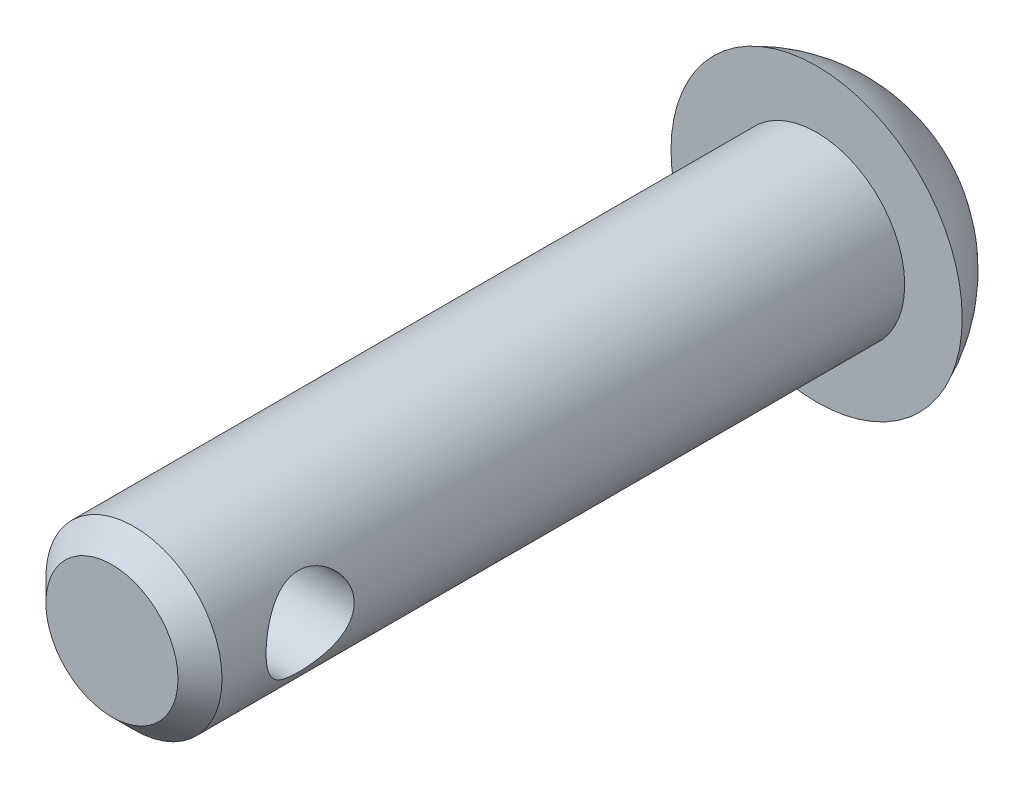
ISO-10303-21;
HEADER;
FILE_DESCRIPTION(('STEP AP214'),'2;1');
FILE_NAME('part.step','',(''),(''),'','','');
FILE_SCHEMA(('AUTOMOTIVE_DESIGN { 1 0 10303 214 1 1 1 1 }'));
ENDSEC;
DATA;
#1=APPLICATION_CONTEXT('core data for automotive mechanical design processes');
#2=APPLICATION_PROTOCOL_DEFINITION('international standard','automotive_design',2000,#1);
#3=PRODUCT_CONTEXT('',#1,'mechanical');
#4=PRODUCT('Part','Part','',(#3));
#5=PRODUCT_RELATED_PRODUCT_CATEGORY('part','',(#4));
#6=PRODUCT_DEFINITION_FORMATION('','',#4);
#7=PRODUCT_DEFINITION_CONTEXT('part definition',#1,'design');
#8=PRODUCT_DEFINITION('design','',#6,#7);
#9=PRODUCT_DEFINITION_SHAPE('','',#8);
#10=(LENGTH_UNIT() NAMED_UNIT(*) SI_UNIT(.MILLI.,.METRE.));
#11=(NAMED_UNIT(*) PLANE_ANGLE_UNIT() SI_UNIT($,.RADIAN.));
#12=(NAMED_UNIT(*) SI_UNIT($,.STERADIAN.) SOLID_ANGLE_UNIT());
#13=UNCERTAINTY_MEASURE_WITH_UNIT(LENGTH_MEASURE(1.E-05),#10,'distance_accuracy_value','');
#14=(GEOMETRIC_REPRESENTATION_CONTEXT(3) GLOBAL_UNCERTAINTY_ASSIGNED_CONTEXT((#13)) GLOBAL_UNIT_ASSIGNED_CONTEXT((#10,
#11,#12)) REPRESENTATION_CONTEXT('',''));
#15=CARTESIAN_POINT('',(0.,0.,0.));
#16=DIRECTION('',(0.,0.,1.));
#17=DIRECTION('',(1.,0.,0.));
#18=AXIS2_PLACEMENT_3D('',#15,#16,#17);
#19=CARTESIAN_POINT('',(0.,0.,-16.));
#20=DIRECTION('',(0.,0.,1.));
#21=DIRECTION('',(1.,0.,0.));
#22=AXIS2_PLACEMENT_3D('',#19,#20,#21);
#23=CYLINDRICAL_SURFACE('',#22,2.);
#24=CARTESIAN_POINT('',(2.,0.,-3.5));
#25=CARTESIAN_POINT('',(1.99999713404151,0.0525719629529865,-3.4999966976805));
#26=CARTESIAN_POINT('',(1.99790491019518,0.105206599698033,-3.49582992687833));
#27=CARTESIAN_POINT('',(1.98974156037396,0.208920235268425,-3.47934711965908));
#28=CARTESIAN_POINT('',(1.98366287828984,0.259996086713504,-3.46701560700235));
#29=CARTESIAN_POINT('',(1.96816279403312,0.358933544880574,-3.43480619138321));
#30=CARTESIAN_POINT('',(1.9587543917752,0.40680680293918,-3.41495761575199));
#31=CARTESIAN_POINT('',(1.93745776515779,0.498472616806565,-3.36842937863506));
#32=CARTESIAN_POINT('',(1.9255697363353,0.54226549399005,-3.34175025575115));
#33=CARTESIAN_POINT('',(1.89956258258057,0.627507817761919,-3.2804827505147));
#34=CARTESIAN_POINT('',(1.88535199127536,0.668655211122112,-3.24551352076036));
#35=CARTESIAN_POINT('',(1.85659970246744,0.744779444866977,-3.16947852075297));
#36=CARTESIAN_POINT('',(1.84205776209035,0.779751583106766,-3.12840814822756));
#37=CARTESIAN_POINT('',(1.81298951197347,0.845252000450278,-3.03751665047662));
#38=CARTESIAN_POINT('',(1.79855186970132,0.875225335551637,-2.98726390165409));
#39=CARTESIAN_POINT('',(1.77285978772321,0.926168226890695,-2.88163266401379));
#40=CARTESIAN_POINT('',(1.7616030760699,0.947144214966334,-2.82625787127725));
#41=CARTESIAN_POINT('',(1.74457867037809,0.978132442188589,-2.71533489457808));
#42=CARTESIAN_POINT('',(1.73852271583714,0.988725857080441,-2.65999554793261));
#43=CARTESIAN_POINT('',(1.73181889948528,1.00042699330885,-2.54802116222052));
#44=CARTESIAN_POINT('',(1.73116569343288,1.00154408837307,-2.49138745912885));
#45=CARTESIAN_POINT('',(1.73510930257248,0.994687287172295,-2.38571397568463));
#46=CARTESIAN_POINT('',(1.73908763662014,0.987784559536822,-2.33657596877695));
#47=CARTESIAN_POINT('',(1.7507622873385,0.966939849056933,-2.24027809062696));
#48=CARTESIAN_POINT('',(1.75845978831776,0.952995623897652,-2.19311885469468));
#49=CARTESIAN_POINT('',(1.77687476412741,0.918209780386004,-2.10077086743434));
#50=CARTESIAN_POINT('',(1.78765840663999,0.897215067115995,-2.05565360121421));
#51=CARTESIAN_POINT('',(1.81103404281404,0.849041687668003,-1.96936570740999));
#52=CARTESIAN_POINT('',(1.82362684780191,0.821860243812468,-1.92819686439991));
#53=CARTESIAN_POINT('',(1.85113157903286,0.758066054912789,-1.84547874725677));
#54=CARTESIAN_POINT('',(1.86613510236746,0.720694458369282,-1.80454312642384));
#55=CARTESIAN_POINT('',(1.89547623300407,0.639555578741374,-1.7292645814091));
#56=CARTESIAN_POINT('',(1.90981351958801,0.595785256574286,-1.69492480796612));
#57=CARTESIAN_POINT('',(1.93701987282964,0.500516505831848,-1.63231433897027));
#58=CARTESIAN_POINT('',(1.94978984162007,0.448753591599409,-1.60439952755426));
#59=CARTESIAN_POINT('',(1.97157881121242,0.340466215488797,-1.55790297095699));
#60=CARTESIAN_POINT('',(1.98060078943553,0.283945576265276,-1.53931381498483));
#61=CARTESIAN_POINT('',(1.99324333741436,0.172766491660702,-1.51352459628332));
#62=CARTESIAN_POINT('',(1.99724938301312,0.118341530548324,-1.50550876425322));
#63=CARTESIAN_POINT('',(2.00073013459102,0.00877959994935372,-1.49853526886551));
#64=CARTESIAN_POINT('',(2.00020698721312,-0.0463570198699013,-1.49957331436052));
#65=CARTESIAN_POINT('',(1.99491192253441,-0.151232971985993,-1.51020668841875));
#66=CARTESIAN_POINT('',(1.9904724568819,-0.201059408049954,-1.51913253273003));
#67=CARTESIAN_POINT('',(1.97822171314819,-0.298406892301917,-1.54423807189509));
#68=CARTESIAN_POINT('',(1.97041006334332,-0.345927685690997,-1.56041856645336));
#69=CARTESIAN_POINT('',(1.95184251413669,-0.438888608449665,-1.59999846643317));
#70=CARTESIAN_POINT('',(1.94100881769939,-0.484230397006154,-1.62359105011681));
#71=CARTESIAN_POINT('',(1.91743974317109,-0.570461361698921,-1.67710753564604));
#72=CARTESIAN_POINT('',(1.90470355565785,-0.611348629775282,-1.70703413459343));
#73=CARTESIAN_POINT('',(1.87708221337464,-0.691767689290653,-1.77576042533287));
#74=CARTESIAN_POINT('',(1.86210884848441,-0.730772077824639,-1.81514286845357));
#75=CARTESIAN_POINT('',(1.83262391603874,-0.80185632111324,-1.8999251512693));
#76=CARTESIAN_POINT('',(1.81811267381526,-0.833931385690841,-1.94532911881637));
#77=CARTESIAN_POINT('',(1.79051192226068,-0.891707914497696,-2.04364365420031));
#78=CARTESIAN_POINT('',(1.77752529663472,-0.917025495878638,-2.09681126620859));
#79=CARTESIAN_POINT('',(1.75574072368126,-0.958082826013803,-2.20751006769252));
#80=CARTESIAN_POINT('',(1.74693738240618,-0.97383491588757,-2.26503552650119));
#81=CARTESIAN_POINT('',(1.73561501008667,-0.993861687449679,-2.37691022286145));
#82=CARTESIAN_POINT('',(1.73257383460491,-0.999092996400865,-2.43103425342904));
#83=CARTESIAN_POINT('',(1.73165354646175,-1.00068915438079,-2.53944706717073));
#84=CARTESIAN_POINT('',(1.73377219627553,-0.997057846624399,-2.59373576873943));
#85=CARTESIAN_POINT('',(1.74237862050025,-0.981926125592263,-2.69548350153202));
#86=CARTESIAN_POINT('',(1.74843094482394,-0.971208314342799,-2.7431004701444));
#87=CARTESIAN_POINT('',(1.76371016187918,-0.943175358224645,-2.83580811942471));
#88=CARTESIAN_POINT('',(1.77293807569676,-0.92585809115981,-2.88089798209197));
#89=CARTESIAN_POINT('',(1.79428530364528,-0.883815745300683,-2.97062485098661));
#90=CARTESIAN_POINT('',(1.80655722396191,-0.858671137816458,-3.0150279018297));
#91=CARTESIAN_POINT('',(1.8323533163459,-0.802150971636635,-3.09927453618059));
#92=CARTESIAN_POINT('',(1.84587813794522,-0.770772171238649,-3.13911573051849));
#93=CARTESIAN_POINT('',(1.87462323159313,-0.698203326664642,-3.21814198235762));
#94=CARTESIAN_POINT('',(1.88984983311469,-0.656284423010172,-3.25665910236192));
#95=CARTESIAN_POINT('',(1.91877752255088,-0.56615480622028,-3.32626298342363));
#96=CARTESIAN_POINT('',(1.9324777860804,-0.517940723256785,-3.35734573942629));
#97=CARTESIAN_POINT('',(1.95698009585103,-0.415931596819947,-3.4112363627622));
#98=CARTESIAN_POINT('',(1.96776096562909,-0.362099503934615,-3.43398416941144));
#99=CARTESIAN_POINT('',(1.98501341363465,-0.250742101294192,-3.46980816791895));
#100=CARTESIAN_POINT('',(1.99149723372932,-0.193227799623166,-3.48291184682958));
#101=CARTESIAN_POINT('',(1.99695461909663,-0.112601946483384,-3.49389741107585));
#102=CARTESIAN_POINT('',(1.99809365339202,-0.0901618794394988,-3.49618264086362));
#103=CARTESIAN_POINT('',(1.99961696977865,-0.0451517318071577,-3.49923466551681));
#104=CARTESIAN_POINT('',(2.00000123103763,-0.0225816476473814,-3.5000014184712));
#105=CARTESIAN_POINT('',(2.,0.,-3.5));
#106=B_SPLINE_CURVE_WITH_KNOTS('',3,(#24,#25,#26,#27,#28,#29,#30,#31,#32,#33,#34,#35,#36,#37,
#38,#39,#40,#41,#42,#43,#44,#45,#46,#47,#48,#49,#50,#51,#52,#53,#54,#55,#56,#57,#58,#59,#60,#61,
#62,#63,#64,#65,#66,#67,#68,#69,#70,#71,#72,#73,#74,#75,#76,#77,#78,#79,#80,#81,#82,#83,#84,#85,
#86,#87,#88,#89,#90,#91,#92,#93,#94,#95,#96,#97,#98,#99,#100,#101,#102,#103,#104,#105),
.UNSPECIFIED.,.T.,.F.,(4,2,2,2,2,2,2,2,2,2,2,2,2,2,2,2,2,2,2,2,2,2,2,2,2,2,2,2,2,2,2,2,2,2,2,2,
2,2,2,2,4),(0.,0.157624257420293,0.315548149709198,0.472862155492298,0.630163760581568,
0.796981758718089,0.963926237654036,1.14381726430753,1.32357947898281,1.4925801214023,
1.6614135732902,1.81005712409321,1.95874803925678,2.11090240168487,2.26312521260222,
2.43464941333878,2.60625534598686,2.78583022214441,2.9652621691228,3.12983290471346,
3.29432564511476,3.44606906506122,3.59782921630932,3.75392856027899,3.91009450748339,
4.08159610644419,4.25321588615432,4.43314682159674,4.61284511940778,4.77529307498374,
4.93767059860005,5.08457930244183,5.23153528783678,5.38836456775614,5.54527561138958,
5.72125242752499,5.89732383376573,6.07464013662925,6.2514490862493,6.31915280137698,
6.38685838514847),.UNSPECIFIED.);
#107=CARTESIAN_POINT('',(2.,0.,-3.5));
#108=VERTEX_POINT('',#107);
#109=EDGE_CURVE('E48',#108,#108,#106,.T.);
#110=ORIENTED_EDGE('',*,*,#109,.F.);
#111=EDGE_LOOP('',(#110));
#112=FACE_BOUND('',#111,.T.);
#113=CARTESIAN_POINT('',(-2.,0.,-3.5));
#114=CARTESIAN_POINT('',(-1.99999713404151,-0.0525719629529865,-3.4999966976805));
#115=CARTESIAN_POINT('',(-1.99790491019518,-0.105206599698033,-3.49582992687833));
#116=CARTESIAN_POINT('',(-1.98974156037396,-0.208920235268425,-3.47934711965908));
#117=CARTESIAN_POINT('',(-1.98366287828984,-0.259996086713504,-3.46701560700235));
#118=CARTESIAN_POINT('',(-1.96816279403312,-0.358933544880574,-3.43480619138321));
#119=CARTESIAN_POINT('',(-1.9587543917752,-0.40680680293918,-3.41495761575199));
#120=CARTESIAN_POINT('',(-1.93745776515779,-0.498472616806565,-3.36842937863506));
#121=CARTESIAN_POINT('',(-1.9255697363353,-0.54226549399005,-3.34175025575115));
#122=CARTESIAN_POINT('',(-1.89956258258057,-0.627507817761919,-3.2804827505147));
#123=CARTESIAN_POINT('',(-1.88535199127536,-0.668655211122112,-3.24551352076036));
#124=CARTESIAN_POINT('',(-1.85659970246744,-0.744779444866977,-3.16947852075297));
#125=CARTESIAN_POINT('',(-1.84205776209035,-0.779751583106766,-3.12840814822756));
#126=CARTESIAN_POINT('',(-1.81298951197347,-0.845252000450278,-3.03751665047662));
#127=CARTESIAN_POINT('',(-1.79855186970132,-0.875225335551637,-2.98726390165409));
#128=CARTESIAN_POINT('',(-1.77285978772321,-0.926168226890695,-2.88163266401379));
#129=CARTESIAN_POINT('',(-1.7616030760699,-0.947144214966334,-2.82625787127725));
#130=CARTESIAN_POINT('',(-1.74457867037809,-0.978132442188589,-2.71533489457808));
#131=CARTESIAN_POINT('',(-1.73852271583714,-0.988725857080441,-2.65999554793261));
#132=CARTESIAN_POINT('',(-1.73181889948528,-1.00042699330885,-2.54802116222052));
#133=CARTESIAN_POINT('',(-1.73116569343288,-1.00154408837307,-2.49138745912885));
#134=CARTESIAN_POINT('',(-1.73510930257248,-0.994687287172295,-2.38571397568463));
#135=CARTESIAN_POINT('',(-1.73908763662014,-0.987784559536822,-2.33657596877695));
#136=CARTESIAN_POINT('',(-1.7507622873385,-0.966939849056933,-2.24027809062696));
#137=CARTESIAN_POINT('',(-1.75845978831776,-0.952995623897652,-2.19311885469468));
#138=CARTESIAN_POINT('',(-1.77687476412741,-0.918209780386004,-2.10077086743434));
#139=CARTESIAN_POINT('',(-1.78765840663999,-0.897215067115995,-2.05565360121421));
#140=CARTESIAN_POINT('',(-1.81103404281404,-0.849041687668003,-1.96936570740999));
#141=CARTESIAN_POINT('',(-1.82362684780191,-0.821860243812468,-1.92819686439991));
#142=CARTESIAN_POINT('',(-1.85113157903286,-0.758066054912789,-1.84547874725677));
#143=CARTESIAN_POINT('',(-1.86613510236746,-0.720694458369282,-1.80454312642384));
#144=CARTESIAN_POINT('',(-1.89547623300407,-0.639555578741374,-1.7292645814091));
#145=CARTESIAN_POINT('',(-1.90981351958801,-0.595785256574286,-1.69492480796612));
#146=CARTESIAN_POINT('',(-1.93701987282964,-0.500516505831848,-1.63231433897027));
#147=CARTESIAN_POINT('',(-1.94978984162007,-0.448753591599409,-1.60439952755426));
#148=CARTESIAN_POINT('',(-1.97157881121242,-0.340466215488797,-1.55790297095699));
#149=CARTESIAN_POINT('',(-1.98060078943553,-0.283945576265276,-1.53931381498483));
#150=CARTESIAN_POINT('',(-1.99324333741436,-0.172766491660702,-1.51352459628332));
#151=CARTESIAN_POINT('',(-1.99724938301312,-0.118341530548324,-1.50550876425322));
#152=CARTESIAN_POINT('',(-2.00073013459102,-0.00877959994935372,-1.49853526886551));
#153=CARTESIAN_POINT('',(-2.00020698721312,0.0463570198699013,-1.49957331436052));
#154=CARTESIAN_POINT('',(-1.99491192253441,0.151232971985993,-1.51020668841875));
#155=CARTESIAN_POINT('',(-1.9904724568819,0.201059408049954,-1.51913253273003));
#156=CARTESIAN_POINT('',(-1.97822171314819,0.298406892301917,-1.54423807189509));
#157=CARTESIAN_POINT('',(-1.97041006334332,0.345927685690997,-1.56041856645336));
#158=CARTESIAN_POINT('',(-1.95184251413669,0.438888608449665,-1.59999846643317));
#159=CARTESIAN_POINT('',(-1.94100881769939,0.484230397006154,-1.62359105011681));
#160=CARTESIAN_POINT('',(-1.91743974317109,0.570461361698921,-1.67710753564604));
#161=CARTESIAN_POINT('',(-1.90470355565785,0.611348629775282,-1.70703413459343));
#162=CARTESIAN_POINT('',(-1.87708221337464,0.691767689290653,-1.77576042533287));
#163=CARTESIAN_POINT('',(-1.86210884848441,0.730772077824639,-1.81514286845357));
#164=CARTESIAN_POINT('',(-1.83262391603874,0.80185632111324,-1.8999251512693));
#165=CARTESIAN_POINT('',(-1.81811267381526,0.833931385690841,-1.94532911881637));
#166=CARTESIAN_POINT('',(-1.79051192226068,0.891707914497696,-2.04364365420031));
#167=CARTESIAN_POINT('',(-1.77752529663472,0.917025495878638,-2.09681126620859));
#168=CARTESIAN_POINT('',(-1.75574072368126,0.958082826013803,-2.20751006769252));
#169=CARTESIAN_POINT('',(-1.74693738240618,0.97383491588757,-2.26503552650119));
#170=CARTESIAN_POINT('',(-1.73561501008667,0.993861687449679,-2.37691022286145));
#171=CARTESIAN_POINT('',(-1.73257383460491,0.999092996400865,-2.43103425342904));
#172=CARTESIAN_POINT('',(-1.73165354646175,1.00068915438079,-2.53944706717073));
#173=CARTESIAN_POINT('',(-1.73377219627553,0.997057846624399,-2.59373576873943));
#174=CARTESIAN_POINT('',(-1.74237862050025,0.981926125592263,-2.69548350153202));
#175=CARTESIAN_POINT('',(-1.74843094482394,0.971208314342799,-2.7431004701444));
#176=CARTESIAN_POINT('',(-1.76371016187918,0.943175358224645,-2.83580811942471));
#177=CARTESIAN_POINT('',(-1.77293807569676,0.92585809115981,-2.88089798209197));
#178=CARTESIAN_POINT('',(-1.79428530364528,0.883815745300683,-2.97062485098661));
#179=CARTESIAN_POINT('',(-1.80655722396191,0.858671137816458,-3.0150279018297));
#180=CARTESIAN_POINT('',(-1.8323533163459,0.802150971636635,-3.09927453618059));
#181=CARTESIAN_POINT('',(-1.84587813794522,0.770772171238649,-3.13911573051849));
#182=CARTESIAN_POINT('',(-1.87462323159313,0.698203326664642,-3.21814198235762));
#183=CARTESIAN_POINT('',(-1.88984983311469,0.656284423010172,-3.25665910236192));
#184=CARTESIAN_POINT('',(-1.91877752255088,0.56615480622028,-3.32626298342363));
#185=CARTESIAN_POINT('',(-1.9324777860804,0.517940723256785,-3.35734573942629));
#186=CARTESIAN_POINT('',(-1.95698009585103,0.415931596819947,-3.4112363627622));
#187=CARTESIAN_POINT('',(-1.96776096562909,0.362099503934615,-3.43398416941144));
#188=CARTESIAN_POINT('',(-1.98501341363465,0.250742101294192,-3.46980816791895));
#189=CARTESIAN_POINT('',(-1.99149723372932,0.193227799623166,-3.48291184682958));
#190=CARTESIAN_POINT('',(-1.99695461909663,0.112601946483384,-3.49389741107585));
#191=CARTESIAN_POINT('',(-1.99809365339202,0.0901618794394988,-3.49618264086362));
#192=CARTESIAN_POINT('',(-1.99961696977865,0.0451517318071577,-3.49923466551681));
#193=CARTESIAN_POINT('',(-2.00000123103763,0.0225816476473814,-3.5000014184712));
#194=CARTESIAN_POINT('',(-2.,0.,-3.5));
#195=B_SPLINE_CURVE_WITH_KNOTS('',3,(#113,#114,#115,#116,#117,#118,#119,#120,#121,#122,#123,
#124,#125,#126,#127,#128,#129,#130,#131,#132,#133,#134,#135,#136,#137,#138,#139,#140,#141,#142,
#143,#144,#145,#146,#147,#148,#149,#150,#151,#152,#153,#154,#155,#156,#157,#158,#159,#160,#161,
#162,#163,#164,#165,#166,#167,#168,#169,#170,#171,#172,#173,#174,#175,#176,#177,#178,#179,#180,
#181,#182,#183,#184,#185,#186,#187,#188,#189,#190,#191,#192,#193,#194),.UNSPECIFIED.,.T.,.F.,(4,
2,2,2,2,2,2,2,2,2,2,2,2,2,2,2,2,2,2,2,2,2,2,2,2,2,2,2,2,2,2,2,2,2,2,2,2,2,2,2,4),(0.,
0.157624257420293,0.315548149709198,0.472862155492298,0.630163760581568,0.796981758718089,
0.963926237654036,1.14381726430753,1.32357947898281,1.4925801214023,1.6614135732902,
1.81005712409321,1.95874803925678,2.11090240168487,2.26312521260222,2.43464941333878,
2.60625534598686,2.78583022214441,2.9652621691228,3.12983290471346,3.29432564511476,
3.44606906506122,3.59782921630932,3.75392856027899,3.91009450748339,4.08159610644419,
4.25321588615432,4.43314682159674,4.61284511940778,4.77529307498374,4.93767059860005,
5.08457930244183,5.23153528783678,5.38836456775614,5.54527561138958,5.72125242752499,
5.89732383376573,6.07464013662925,6.2514490862493,6.31915280137698,6.38685838514847),.UNSPECIFIED.);
#196=CARTESIAN_POINT('',(-2.,0.,-3.5));
#197=VERTEX_POINT('',#196);
#198=EDGE_CURVE('E64',#197,#197,#195,.T.);
#199=ORIENTED_EDGE('',*,*,#198,.F.);
#200=EDGE_LOOP('',(#199));
#201=FACE_BOUND('',#200,.T.);
#202=CARTESIAN_POINT('',(0.,0.,-0.500000000000002));
#203=DIRECTION('',(0.,0.,1.));
#204=DIRECTION('',(1.,0.,0.));
#205=AXIS2_PLACEMENT_3D('',#202,#203,#204);
#206=CIRCLE('',#205,2.);
#207=CARTESIAN_POINT('',(2.,0.,-0.500000000000002));
#208=VERTEX_POINT('',#207);
#209=EDGE_CURVE('E10',#208,#208,#206,.F.);
#210=ORIENTED_EDGE('',*,*,#209,.T.);
#211=EDGE_LOOP('',(#210));
#212=FACE_BOUND('',#211,.T.);
#213=CARTESIAN_POINT('',(0.,0.,-16.));
#214=DIRECTION('',(0.,0.,-1.));
#215=DIRECTION('',(-1.,0.,0.));
#216=AXIS2_PLACEMENT_3D('',#213,#214,#215);
#217=CIRCLE('',#216,2.);
#218=CARTESIAN_POINT('',(-2.,0.,-16.));
#219=VERTEX_POINT('',#218);
#220=EDGE_CURVE('E61',#219,#219,#217,.F.);
#221=ORIENTED_EDGE('',*,*,#220,.T.);
#222=EDGE_LOOP('',(#221));
#223=FACE_BOUND('',#222,.T.);
#224=ADVANCED_FACE('F43',(#112,#201,#212,#223),#23,.T.);
#225=CARTESIAN_POINT('',(0.,0.,0.));
#226=DIRECTION('',(0.,0.,1.));
#227=DIRECTION('',(1.,0.,0.));
#228=AXIS2_PLACEMENT_3D('',#225,#226,#227);
#229=PLANE('',#228);
#230=CARTESIAN_POINT('',(0.,0.,0.));
#231=DIRECTION('',(0.,0.,1.));
#232=DIRECTION('',(1.,0.,0.));
#233=AXIS2_PLACEMENT_3D('',#230,#231,#232);
#234=CIRCLE('',#233,1.5);
#235=CARTESIAN_POINT('',(1.5,0.,0.));
#236=VERTEX_POINT('',#235);
#237=EDGE_CURVE('E56',#236,#236,#234,.T.);
#238=ORIENTED_EDGE('',*,*,#237,.T.);
#239=EDGE_LOOP('',(#238));
#240=FACE_BOUND('',#239,.T.);
#241=ADVANCED_FACE('F84',(#240),#229,.T.);
#242=CARTESIAN_POINT('',(0.,0.,0.));
#243=DIRECTION('',(0.,0.,-1.));
#244=DIRECTION('',(-1.,0.,0.));
#245=AXIS2_PLACEMENT_3D('',#242,#243,#244);
#246=CONICAL_SURFACE('',#245,1.5,0.785398163397447);
#247=ORIENTED_EDGE('',*,*,#209,.F.);
#248=EDGE_LOOP('',(#247));
#249=FACE_BOUND('',#248,.T.);
#250=ORIENTED_EDGE('',*,*,#237,.F.);
#251=EDGE_LOOP('',(#250));
#252=FACE_BOUND('',#251,.T.);
#253=ADVANCED_FACE('F46',(#249,#252),#246,.T.);
#254=CARTESIAN_POINT('',(0.,0.,-16.));
#255=DIRECTION('',(0.,0.,-1.));
#256=DIRECTION('',(-1.,0.,0.));
#257=AXIS2_PLACEMENT_3D('',#254,#255,#256);
#258=PLANE('',#257);
#259=ORIENTED_EDGE('',*,*,#220,.F.);
#260=EDGE_LOOP('',(#259));
#261=FACE_BOUND('',#260,.T.);
#262=CARTESIAN_POINT('',(0.,0.,-16.));
#263=DIRECTION('',(0.,0.,1.));
#264=DIRECTION('',(1.,0.,0.));
#265=AXIS2_PLACEMENT_3D('',#262,#263,#264);
#266=CIRCLE('',#265,3.30589830695454);
#267=CARTESIAN_POINT('',(3.30589830695454,0.,-16.));
#268=VERTEX_POINT('',#267);
#269=EDGE_CURVE('E104',#268,#268,#266,.T.);
#270=ORIENTED_EDGE('',*,*,#269,.T.);
#271=EDGE_LOOP('',(#270));
#272=FACE_BOUND('',#271,.T.);
#273=ADVANCED_FACE('F80',(#261,#272),#258,.F.);
#274=CARTESIAN_POINT('',(0.,0.,-14.5748556620205));
#275=DIRECTION('',(0.,0.,1.));
#276=DIRECTION('',(0.,1.,0.));
#277=AXIS2_PLACEMENT_3D('',#274,#275,#276);
#278=SPHERICAL_SURFACE('',#277,3.6);
#279=ORIENTED_EDGE('',*,*,#269,.F.);
#280=EDGE_LOOP('',(#279));
#281=FACE_BOUND('',#280,.T.);
#282=ADVANCED_FACE('F75',(#281),#278,.T.);
#283=CARTESIAN_POINT('',(-3.30589830695454,0.,-2.5));
#284=DIRECTION('',(1.,0.,0.));
#285=DIRECTION('',(0.,0.,-1.));
#286=AXIS2_PLACEMENT_3D('',#283,#284,#285);
#287=CYLINDRICAL_SURFACE('',#286,1.);
#288=ORIENTED_EDGE('',*,*,#109,.T.);
#289=EDGE_LOOP('',(#288));
#290=FACE_BOUND('',#289,.T.);
#291=ORIENTED_EDGE('',*,*,#198,.T.);
#292=EDGE_LOOP('',(#291));
#293=FACE_BOUND('',#292,.T.);
#294=ADVANCED_FACE('F71',(#290,#293),#287,.F.);
#295=CLOSED_SHELL('',(#224,#241,#253,#273,#282,#294));
#296=MANIFOLD_SOLID_BREP('B2',#295);
#297=ADVANCED_BREP_SHAPE_REPRESENTATION('',(#18,#296),#14);
#298=SHAPE_DEFINITION_REPRESENTATION(#9,#297);
ENDSEC;
END-ISO-10303-21;
